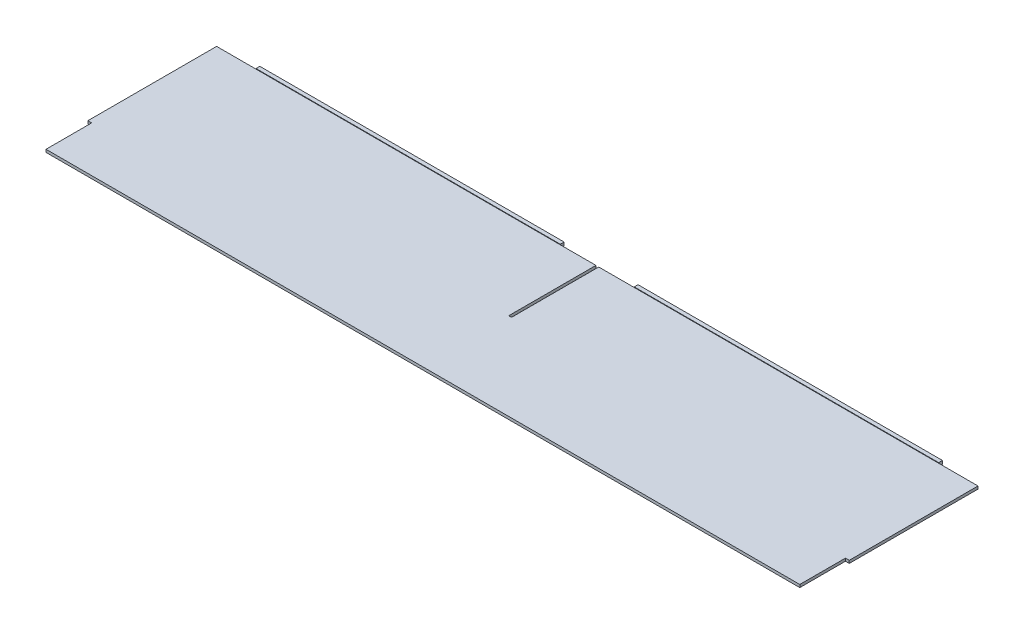
ISO-10303-21;
HEADER;
FILE_DESCRIPTION(('STEP AP214'),'2;1');
FILE_NAME('part.step','',(''),(''),'','','');
FILE_SCHEMA(('AUTOMOTIVE_DESIGN { 1 0 10303 214 1 1 1 1 }'));
ENDSEC;
DATA;
#1=APPLICATION_CONTEXT('core data for automotive mechanical design processes');
#2=APPLICATION_PROTOCOL_DEFINITION('international standard','automotive_design',2000,#1);
#3=PRODUCT_CONTEXT('',#1,'mechanical');
#4=PRODUCT('Part','Part','',(#3));
#5=PRODUCT_RELATED_PRODUCT_CATEGORY('part','',(#4));
#6=PRODUCT_DEFINITION_FORMATION('','',#4);
#7=PRODUCT_DEFINITION_CONTEXT('part definition',#1,'design');
#8=PRODUCT_DEFINITION('design','',#6,#7);
#9=PRODUCT_DEFINITION_SHAPE('','',#8);
#10=(LENGTH_UNIT() NAMED_UNIT(*) SI_UNIT(.MILLI.,.METRE.));
#11=(NAMED_UNIT(*) PLANE_ANGLE_UNIT() SI_UNIT($,.RADIAN.));
#12=(NAMED_UNIT(*) SI_UNIT($,.STERADIAN.) SOLID_ANGLE_UNIT());
#13=UNCERTAINTY_MEASURE_WITH_UNIT(LENGTH_MEASURE(1.E-05),#10,'distance_accuracy_value','');
#14=(GEOMETRIC_REPRESENTATION_CONTEXT(3) GLOBAL_UNCERTAINTY_ASSIGNED_CONTEXT((#13)) GLOBAL_UNIT_ASSIGNED_CONTEXT((#10,
#11,#12)) REPRESENTATION_CONTEXT('',''));
#15=CARTESIAN_POINT('',(0.,0.,0.));
#16=DIRECTION('',(0.,0.,1.));
#17=DIRECTION('',(1.,0.,0.));
#18=AXIS2_PLACEMENT_3D('',#15,#16,#17);
#19=CARTESIAN_POINT('',(-317.6778,1.143,-72.771));
#20=DIRECTION('',(0.,0.,1.));
#21=DIRECTION('',(1.,0.,0.));
#22=AXIS2_PLACEMENT_3D('',#19,#20,#21);
#23=PLANE('',#22);
#24=DIRECTION('',(-1.,0.,0.));
#25=VECTOR('',#24,1.);
#26=CARTESIAN_POINT('',(-317.6778,1.143,-72.771));
#27=LINE('',#26,#25);
#28=CARTESIAN_POINT('',(-1.14299999999913,1.143,-72.771));
#29=VERTEX_POINT('',#28);
#30=CARTESIAN_POINT('',(-30.8229000000015,1.143,-72.771));
#31=VERTEX_POINT('',#30);
#32=EDGE_CURVE('E200',#29,#31,#27,.T.);
#33=ORIENTED_EDGE('',*,*,#32,.F.);
#34=DIRECTION('',(0.,-1.,0.));
#35=VECTOR('',#34,1.);
#36=CARTESIAN_POINT('',(-1.14299999999912,1.143,-72.771));
#37=LINE('',#36,#35);
#38=CARTESIAN_POINT('',(-1.14299999999913,-1.143,-72.771));
#39=VERTEX_POINT('',#38);
#40=EDGE_CURVE('E11',#29,#39,#37,.T.);
#41=ORIENTED_EDGE('',*,*,#40,.T.);
#42=DIRECTION('',(-1.,0.,0.));
#43=VECTOR('',#42,1.);
#44=CARTESIAN_POINT('',(-317.6778,-1.143,-72.771));
#45=LINE('',#44,#43);
#46=CARTESIAN_POINT('',(-30.8229000000015,-1.143,-72.771));
#47=VERTEX_POINT('',#46);
#48=EDGE_CURVE('E198',#39,#47,#45,.T.);
#49=ORIENTED_EDGE('',*,*,#48,.T.);
#50=DIRECTION('',(0.,-1.,0.));
#51=VECTOR('',#50,1.);
#52=CARTESIAN_POINT('',(-30.8229000000015,-1.143,-72.771));
#53=LINE('',#52,#51);
#54=EDGE_CURVE('E232',#31,#47,#53,.T.);
#55=ORIENTED_EDGE('',*,*,#54,.F.);
#56=EDGE_LOOP('',(#33,#41,#49,#55));
#57=FACE_BOUND('',#56,.T.);
#58=ADVANCED_FACE('F34',(#57),#23,.F.);
#59=CARTESIAN_POINT('',(317.6778,1.143,-72.771));
#60=DIRECTION('',(-1.,0.,0.));
#61=DIRECTION('',(0.,0.,1.));
#62=AXIS2_PLACEMENT_3D('',#59,#60,#61);
#63=PLANE('',#62);
#64=DIRECTION('',(0.,-1.,0.));
#65=VECTOR('',#64,1.);
#66=CARTESIAN_POINT('',(317.6778,1.58749999999994,34.671));
#67=LINE('',#66,#65);
#68=CARTESIAN_POINT('',(317.6778,1.143,34.671));
#69=VERTEX_POINT('',#68);
#70=CARTESIAN_POINT('',(317.6778,-1.143,34.671));
#71=VERTEX_POINT('',#70);
#72=EDGE_CURVE('E298',#69,#71,#67,.T.);
#73=ORIENTED_EDGE('',*,*,#72,.T.);
#74=DIRECTION('',(0.,0.,-1.));
#75=VECTOR('',#74,1.);
#76=CARTESIAN_POINT('',(317.6778,-1.143,-72.771));
#77=LINE('',#76,#75);
#78=CARTESIAN_POINT('',(317.6778,-1.143,-72.771));
#79=VERTEX_POINT('',#78);
#80=EDGE_CURVE('E210',#71,#79,#77,.T.);
#81=ORIENTED_EDGE('',*,*,#80,.T.);
#82=DIRECTION('',(0.,-1.,0.));
#83=VECTOR('',#82,1.);
#84=CARTESIAN_POINT('',(317.6778,1.143,-72.771));
#85=LINE('',#84,#83);
#86=CARTESIAN_POINT('',(317.6778,1.143,-72.771));
#87=VERTEX_POINT('',#86);
#88=EDGE_CURVE('E230',#87,#79,#85,.T.);
#89=ORIENTED_EDGE('',*,*,#88,.F.);
#90=DIRECTION('',(0.,0.,-1.));
#91=VECTOR('',#90,1.);
#92=CARTESIAN_POINT('',(317.6778,1.143,-72.771));
#93=LINE('',#92,#91);
#94=EDGE_CURVE('E225',#69,#87,#93,.T.);
#95=ORIENTED_EDGE('',*,*,#94,.F.);
#96=EDGE_LOOP('',(#73,#81,#89,#95));
#97=FACE_BOUND('',#96,.T.);
#98=ADVANCED_FACE('F36',(#97),#63,.F.);
#99=CARTESIAN_POINT('',(-317.6778,1.143,72.771));
#100=DIRECTION('',(0.,0.,-1.));
#101=DIRECTION('',(-1.,0.,0.));
#102=AXIS2_PLACEMENT_3D('',#99,#100,#101);
#103=PLANE('',#102);
#104=DIRECTION('',(0.,-1.,0.));
#105=VECTOR('',#104,1.);
#106=CARTESIAN_POINT('',(314.5028,1.58749999999994,72.771));
#107=LINE('',#106,#105);
#108=CARTESIAN_POINT('',(314.5028,1.143,72.771));
#109=VERTEX_POINT('',#108);
#110=CARTESIAN_POINT('',(314.5028,-1.143,72.771));
#111=VERTEX_POINT('',#110);
#112=EDGE_CURVE('E57',#109,#111,#107,.T.);
#113=ORIENTED_EDGE('',*,*,#112,.F.);
#114=DIRECTION('',(1.,0.,0.));
#115=VECTOR('',#114,1.);
#116=CARTESIAN_POINT('',(-317.6778,1.143,72.771));
#117=LINE('',#116,#115);
#118=CARTESIAN_POINT('',(-314.5028,1.143,72.771));
#119=VERTEX_POINT('',#118);
#120=EDGE_CURVE('E231',#119,#109,#117,.T.);
#121=ORIENTED_EDGE('',*,*,#120,.F.);
#122=DIRECTION('',(0.,-1.,0.));
#123=VECTOR('',#122,1.);
#124=CARTESIAN_POINT('',(-314.5028,1.58749999999994,72.771));
#125=LINE('',#124,#123);
#126=CARTESIAN_POINT('',(-314.5028,-1.143,72.771));
#127=VERTEX_POINT('',#126);
#128=EDGE_CURVE('E322',#119,#127,#125,.T.);
#129=ORIENTED_EDGE('',*,*,#128,.T.);
#130=DIRECTION('',(1.,0.,0.));
#131=VECTOR('',#130,1.);
#132=CARTESIAN_POINT('',(-317.6778,-1.143,72.771));
#133=LINE('',#132,#131);
#134=EDGE_CURVE('E219',#127,#111,#133,.T.);
#135=ORIENTED_EDGE('',*,*,#134,.T.);
#136=EDGE_LOOP('',(#113,#121,#129,#135));
#137=FACE_BOUND('',#136,.T.);
#138=ADVANCED_FACE('F397',(#137),#103,.F.);
#139=CARTESIAN_POINT('',(0.,1.143,0.));
#140=DIRECTION('',(0.,1.,0.));
#141=DIRECTION('',(0.,0.,1.));
#142=AXIS2_PLACEMENT_3D('',#139,#140,#141);
#143=PLANE('',#142);
#144=DIRECTION('',(0.,0.,1.));
#145=VECTOR('',#144,1.);
#146=CARTESIAN_POINT('',(-1.14299999999912,1.143,0.));
#147=LINE('',#146,#145);
#148=CARTESIAN_POINT('',(-1.14299999999912,1.143,0.));
#149=VERTEX_POINT('',#148);
#150=EDGE_CURVE('E403',#29,#149,#147,.T.);
#151=ORIENTED_EDGE('',*,*,#150,.F.);
#152=ORIENTED_EDGE('',*,*,#32,.T.);
#153=CARTESIAN_POINT('',(-284.822900000001,1.143,-72.771));
#154=VERTEX_POINT('',#153);
#155=EDGE_CURVE('E289',#31,#154,#27,.T.);
#156=ORIENTED_EDGE('',*,*,#155,.T.);
#157=CARTESIAN_POINT('',(-317.6778,1.143,-72.771));
#158=VERTEX_POINT('',#157);
#159=EDGE_CURVE('E283',#154,#158,#27,.T.);
#160=ORIENTED_EDGE('',*,*,#159,.T.);
#161=DIRECTION('',(0.,0.,1.));
#162=VECTOR('',#161,1.);
#163=CARTESIAN_POINT('',(-317.6778,1.143,-72.771));
#164=LINE('',#163,#162);
#165=CARTESIAN_POINT('',(-317.6778,1.143,34.671));
#166=VERTEX_POINT('',#165);
#167=EDGE_CURVE('E287',#158,#166,#164,.T.);
#168=ORIENTED_EDGE('',*,*,#167,.T.);
#169=DIRECTION('',(-1.,0.,0.));
#170=VECTOR('',#169,1.);
#171=CARTESIAN_POINT('',(0.,1.143,34.671));
#172=LINE('',#171,#170);
#173=CARTESIAN_POINT('',(-314.5028,1.143,34.671));
#174=VERTEX_POINT('',#173);
#175=EDGE_CURVE('E325',#174,#166,#172,.T.);
#176=ORIENTED_EDGE('',*,*,#175,.F.);
#177=DIRECTION('',(0.,0.,-1.));
#178=VECTOR('',#177,1.);
#179=CARTESIAN_POINT('',(-314.5028,1.143,0.));
#180=LINE('',#179,#178);
#181=EDGE_CURVE('E330',#119,#174,#180,.T.);
#182=ORIENTED_EDGE('',*,*,#181,.F.);
#183=ORIENTED_EDGE('',*,*,#120,.T.);
#184=DIRECTION('',(0.,0.,-1.));
#185=VECTOR('',#184,1.);
#186=CARTESIAN_POINT('',(314.5028,1.143,0.));
#187=LINE('',#186,#185);
#188=CARTESIAN_POINT('',(314.5028,1.143,34.671));
#189=VERTEX_POINT('',#188);
#190=EDGE_CURVE('E309',#109,#189,#187,.T.);
#191=ORIENTED_EDGE('',*,*,#190,.T.);
#192=DIRECTION('',(1.,0.,0.));
#193=VECTOR('',#192,1.);
#194=CARTESIAN_POINT('',(0.,1.143,34.671));
#195=LINE('',#194,#193);
#196=EDGE_CURVE('E308',#189,#69,#195,.T.);
#197=ORIENTED_EDGE('',*,*,#196,.T.);
#198=ORIENTED_EDGE('',*,*,#94,.T.);
#199=CARTESIAN_POINT('',(284.822900000001,1.143,-72.771));
#200=VERTEX_POINT('',#199);
#201=EDGE_CURVE('E284',#87,#200,#27,.T.);
#202=ORIENTED_EDGE('',*,*,#201,.T.);
#203=DIRECTION('',(1.,0.,0.));
#204=VECTOR('',#203,1.);
#205=CARTESIAN_POINT('',(0.,1.143,-72.771));
#206=LINE('',#205,#204);
#207=CARTESIAN_POINT('',(30.8229000000014,1.143,-72.771));
#208=VERTEX_POINT('',#207);
#209=EDGE_CURVE('E242',#208,#200,#206,.T.);
#210=ORIENTED_EDGE('',*,*,#209,.F.);
#211=CARTESIAN_POINT('',(1.19380000000086,1.143,-72.771));
#212=VERTEX_POINT('',#211);
#213=EDGE_CURVE('E288',#208,#212,#27,.T.);
#214=ORIENTED_EDGE('',*,*,#213,.T.);
#215=DIRECTION('',(0.,0.,-1.));
#216=VECTOR('',#215,1.);
#217=CARTESIAN_POINT('',(1.19380000000088,1.143,0.));
#218=LINE('',#217,#216);
#219=CARTESIAN_POINT('',(1.19380000000088,1.143,0.));
#220=VERTEX_POINT('',#219);
#221=EDGE_CURVE('E49',#220,#212,#218,.T.);
#222=ORIENTED_EDGE('',*,*,#221,.F.);
#223=DIRECTION('',(1.,0.,0.));
#224=VECTOR('',#223,1.);
#225=CARTESIAN_POINT('',(0.,1.143,0.));
#226=LINE('',#225,#224);
#227=EDGE_CURVE('E400',#149,#220,#226,.T.);
#228=ORIENTED_EDGE('',*,*,#227,.F.);
#229=EDGE_LOOP('',(#151,#152,#156,#160,#168,#176,#182,#183,#191,#197,#198,#202,#210,#214,#222,#228));
#230=FACE_BOUND('',#229,.T.);
#231=ADVANCED_FACE('F305',(#230),#143,.T.);
#232=CARTESIAN_POINT('',(0.,-1.143,0.));
#233=DIRECTION('',(0.,1.,0.));
#234=DIRECTION('',(0.,0.,1.));
#235=AXIS2_PLACEMENT_3D('',#232,#233,#234);
#236=PLANE('',#235);
#237=ORIENTED_EDGE('',*,*,#48,.F.);
#238=DIRECTION('',(0.,0.,-1.));
#239=VECTOR('',#238,1.);
#240=CARTESIAN_POINT('',(-1.14299999999913,-1.143,-72.771));
#241=LINE('',#240,#239);
#242=CARTESIAN_POINT('',(-1.14299999999912,-1.143,0.));
#243=VERTEX_POINT('',#242);
#244=EDGE_CURVE('E184',#243,#39,#241,.T.);
#245=ORIENTED_EDGE('',*,*,#244,.F.);
#246=DIRECTION('',(-1.,0.,0.));
#247=VECTOR('',#246,1.);
#248=CARTESIAN_POINT('',(-1.14299999999912,-1.143,0.));
#249=LINE('',#248,#247);
#250=CARTESIAN_POINT('',(1.19380000000088,-1.143,0.));
#251=VERTEX_POINT('',#250);
#252=EDGE_CURVE('E549',#251,#243,#249,.T.);
#253=ORIENTED_EDGE('',*,*,#252,.F.);
#254=DIRECTION('',(0.,0.,1.));
#255=VECTOR('',#254,1.);
#256=CARTESIAN_POINT('',(1.19380000000087,-1.143,-72.771));
#257=LINE('',#256,#255);
#258=CARTESIAN_POINT('',(1.19380000000087,-1.143,-72.771));
#259=VERTEX_POINT('',#258);
#260=EDGE_CURVE('E193',#259,#251,#257,.T.);
#261=ORIENTED_EDGE('',*,*,#260,.F.);
#262=CARTESIAN_POINT('',(30.8229000000015,-1.143,-72.771));
#263=VERTEX_POINT('',#262);
#264=EDGE_CURVE('E205',#263,#259,#45,.T.);
#265=ORIENTED_EDGE('',*,*,#264,.F.);
#266=DIRECTION('',(0.,0.,1.));
#267=VECTOR('',#266,1.);
#268=CARTESIAN_POINT('',(30.8229000000015,-1.143,-75.946));
#269=LINE('',#268,#267);
#270=CARTESIAN_POINT('',(30.8229000000015,-1.143,-75.946));
#271=VERTEX_POINT('',#270);
#272=EDGE_CURVE('E255',#271,#263,#269,.T.);
#273=ORIENTED_EDGE('',*,*,#272,.F.);
#274=DIRECTION('',(-1.,0.,0.));
#275=VECTOR('',#274,1.);
#276=CARTESIAN_POINT('',(284.822900000001,-1.143,-75.946));
#277=LINE('',#276,#275);
#278=CARTESIAN_POINT('',(284.822900000001,-1.143,-75.946));
#279=VERTEX_POINT('',#278);
#280=EDGE_CURVE('E335',#279,#271,#277,.T.);
#281=ORIENTED_EDGE('',*,*,#280,.F.);
#282=DIRECTION('',(0.,0.,1.));
#283=VECTOR('',#282,1.);
#284=CARTESIAN_POINT('',(284.822900000001,-1.143,-75.946));
#285=LINE('',#284,#283);
#286=CARTESIAN_POINT('',(284.822900000001,-1.143,-72.771));
#287=VERTEX_POINT('',#286);
#288=EDGE_CURVE('E247',#279,#287,#285,.T.);
#289=ORIENTED_EDGE('',*,*,#288,.T.);
#290=EDGE_CURVE('E208',#79,#287,#45,.T.);
#291=ORIENTED_EDGE('',*,*,#290,.F.);
#292=ORIENTED_EDGE('',*,*,#80,.F.);
#293=DIRECTION('',(-1.,0.,0.));
#294=VECTOR('',#293,1.);
#295=CARTESIAN_POINT('',(317.6778,-1.143,34.671));
#296=LINE('',#295,#294);
#297=CARTESIAN_POINT('',(314.5028,-1.143,34.671));
#298=VERTEX_POINT('',#297);
#299=EDGE_CURVE('E399',#71,#298,#296,.T.);
#300=ORIENTED_EDGE('',*,*,#299,.T.);
#301=DIRECTION('',(0.,0.,1.));
#302=VECTOR('',#301,1.);
#303=CARTESIAN_POINT('',(314.5028,-1.143,72.771));
#304=LINE('',#303,#302);
#305=EDGE_CURVE('E398',#298,#111,#304,.T.);
#306=ORIENTED_EDGE('',*,*,#305,.T.);
#307=ORIENTED_EDGE('',*,*,#134,.F.);
#308=DIRECTION('',(0.,0.,1.));
#309=VECTOR('',#308,1.);
#310=CARTESIAN_POINT('',(-314.5028,-1.143,72.771));
#311=LINE('',#310,#309);
#312=CARTESIAN_POINT('',(-314.5028,-1.143,34.671));
#313=VERTEX_POINT('',#312);
#314=EDGE_CURVE('E315',#313,#127,#311,.T.);
#315=ORIENTED_EDGE('',*,*,#314,.F.);
#316=DIRECTION('',(1.,0.,0.));
#317=VECTOR('',#316,1.);
#318=CARTESIAN_POINT('',(-317.6778,-1.143,34.671));
#319=LINE('',#318,#317);
#320=CARTESIAN_POINT('',(-317.6778,-1.143,34.671));
#321=VERTEX_POINT('',#320);
#322=EDGE_CURVE('E312',#321,#313,#319,.T.);
#323=ORIENTED_EDGE('',*,*,#322,.F.);
#324=DIRECTION('',(0.,0.,1.));
#325=VECTOR('',#324,1.);
#326=CARTESIAN_POINT('',(-317.6778,-1.143,-72.771));
#327=LINE('',#326,#325);
#328=CARTESIAN_POINT('',(-317.6778,-1.143,-72.771));
#329=VERTEX_POINT('',#328);
#330=EDGE_CURVE('E213',#329,#321,#327,.T.);
#331=ORIENTED_EDGE('',*,*,#330,.F.);
#332=CARTESIAN_POINT('',(-284.822900000001,-1.143,-72.771));
#333=VERTEX_POINT('',#332);
#334=EDGE_CURVE('E206',#333,#329,#45,.T.);
#335=ORIENTED_EDGE('',*,*,#334,.F.);
#336=DIRECTION('',(0.,0.,1.));
#337=VECTOR('',#336,1.);
#338=CARTESIAN_POINT('',(-284.822900000001,-1.143,-75.946));
#339=LINE('',#338,#337);
#340=CARTESIAN_POINT('',(-284.822900000001,-1.143,-75.946));
#341=VERTEX_POINT('',#340);
#342=EDGE_CURVE('E275',#341,#333,#339,.T.);
#343=ORIENTED_EDGE('',*,*,#342,.F.);
#344=DIRECTION('',(-1.,0.,0.));
#345=VECTOR('',#344,1.);
#346=CARTESIAN_POINT('',(-30.8229000000015,-1.143,-75.946));
#347=LINE('',#346,#345);
#348=CARTESIAN_POINT('',(-30.8229000000015,-1.143,-75.946));
#349=VERTEX_POINT('',#348);
#350=EDGE_CURVE('E262',#349,#341,#347,.T.);
#351=ORIENTED_EDGE('',*,*,#350,.F.);
#352=DIRECTION('',(0.,0.,1.));
#353=VECTOR('',#352,1.);
#354=CARTESIAN_POINT('',(-30.8229000000015,-1.143,-75.946));
#355=LINE('',#354,#353);
#356=EDGE_CURVE('E204',#349,#47,#355,.T.);
#357=ORIENTED_EDGE('',*,*,#356,.T.);
#358=EDGE_LOOP('',(#237,#245,#253,#261,#265,#273,#281,#289,#291,#292,#300,#306,#307,#315,#323,
#331,#335,#343,#351,#357));
#359=FACE_BOUND('',#358,.T.);
#360=ADVANCED_FACE('F202',(#359),#236,.F.);
#361=DIRECTION('',(0.,-1.,0.));
#362=VECTOR('',#361,1.);
#363=CARTESIAN_POINT('',(284.822900000001,-1.143,-72.771));
#364=LINE('',#363,#362);
#365=EDGE_CURVE('E303',#200,#287,#364,.T.);
#366=ORIENTED_EDGE('',*,*,#365,.F.);
#367=ORIENTED_EDGE('',*,*,#201,.F.);
#368=ORIENTED_EDGE('',*,*,#88,.T.);
#369=ORIENTED_EDGE('',*,*,#290,.T.);
#370=EDGE_LOOP('',(#366,#367,#368,#369));
#371=FACE_BOUND('',#370,.T.);
#372=ADVANCED_FACE('F302',(#371),#23,.F.);
#373=ORIENTED_EDGE('',*,*,#264,.T.);
#374=DIRECTION('',(0.,1.,0.));
#375=VECTOR('',#374,1.);
#376=CARTESIAN_POINT('',(1.19380000000086,1.143,-72.771));
#377=LINE('',#376,#375);
#378=EDGE_CURVE('E42',#259,#212,#377,.T.);
#379=ORIENTED_EDGE('',*,*,#378,.T.);
#380=ORIENTED_EDGE('',*,*,#213,.F.);
#381=DIRECTION('',(0.,1.,0.));
#382=VECTOR('',#381,1.);
#383=CARTESIAN_POINT('',(30.8229000000015,1.58749999999994,-72.771));
#384=LINE('',#383,#382);
#385=EDGE_CURVE('E346',#263,#208,#384,.T.);
#386=ORIENTED_EDGE('',*,*,#385,.F.);
#387=EDGE_LOOP('',(#373,#379,#380,#386));
#388=FACE_BOUND('',#387,.T.);
#389=ADVANCED_FACE('F363',(#388),#23,.F.);
#390=DIRECTION('',(0.,1.,0.));
#391=VECTOR('',#390,1.);
#392=CARTESIAN_POINT('',(-284.822900000001,1.58749999999994,-72.771));
#393=LINE('',#392,#391);
#394=EDGE_CURVE('E245',#333,#154,#393,.T.);
#395=ORIENTED_EDGE('',*,*,#394,.F.);
#396=ORIENTED_EDGE('',*,*,#334,.T.);
#397=DIRECTION('',(0.,-1.,0.));
#398=VECTOR('',#397,1.);
#399=CARTESIAN_POINT('',(-317.6778,1.143,-72.771));
#400=LINE('',#399,#398);
#401=EDGE_CURVE('E228',#158,#329,#400,.T.);
#402=ORIENTED_EDGE('',*,*,#401,.F.);
#403=ORIENTED_EDGE('',*,*,#159,.F.);
#404=EDGE_LOOP('',(#395,#396,#402,#403));
#405=FACE_BOUND('',#404,.T.);
#406=ADVANCED_FACE('F370',(#405),#23,.F.);
#407=CARTESIAN_POINT('',(-317.6778,1.143,-72.771));
#408=DIRECTION('',(1.,0.,0.));
#409=DIRECTION('',(0.,0.,-1.));
#410=AXIS2_PLACEMENT_3D('',#407,#408,#409);
#411=PLANE('',#410);
#412=ORIENTED_EDGE('',*,*,#330,.T.);
#413=DIRECTION('',(0.,-1.,0.));
#414=VECTOR('',#413,1.);
#415=CARTESIAN_POINT('',(-317.6778,1.58749999999994,34.671));
#416=LINE('',#415,#414);
#417=EDGE_CURVE('E321',#166,#321,#416,.T.);
#418=ORIENTED_EDGE('',*,*,#417,.F.);
#419=ORIENTED_EDGE('',*,*,#167,.F.);
#420=ORIENTED_EDGE('',*,*,#401,.T.);
#421=EDGE_LOOP('',(#412,#418,#419,#420));
#422=FACE_BOUND('',#421,.T.);
#423=ADVANCED_FACE('F385',(#422),#411,.F.);
#424=CARTESIAN_POINT('',(0.,0.,-72.771));
#425=DIRECTION('',(0.,0.,1.));
#426=DIRECTION('',(1.,0.,0.));
#427=AXIS2_PLACEMENT_3D('',#424,#425,#426);
#428=PLANE('',#427);
#429=ORIENTED_EDGE('',*,*,#155,.F.);
#430=CARTESIAN_POINT('',(-30.8229000000015,1.58749999999994,-72.771));
#431=VERTEX_POINT('',#430);
#432=EDGE_CURVE('E236',#431,#31,#53,.T.);
#433=ORIENTED_EDGE('',*,*,#432,.F.);
#434=DIRECTION('',(1.,0.,0.));
#435=VECTOR('',#434,1.);
#436=CARTESIAN_POINT('',(-30.8229000000015,1.58749999999994,-72.771));
#437=LINE('',#436,#435);
#438=CARTESIAN_POINT('',(-284.822900000001,1.58749999999994,-72.771));
#439=VERTEX_POINT('',#438);
#440=EDGE_CURVE('E263',#439,#431,#437,.T.);
#441=ORIENTED_EDGE('',*,*,#440,.F.);
#442=EDGE_CURVE('E241',#154,#439,#393,.T.);
#443=ORIENTED_EDGE('',*,*,#442,.F.);
#444=EDGE_LOOP('',(#429,#433,#441,#443));
#445=FACE_BOUND('',#444,.T.);
#446=ADVANCED_FACE('F375',(#445),#428,.T.);
#447=CARTESIAN_POINT('',(-30.8229000000015,-1.143,-75.946));
#448=DIRECTION('',(-1.,0.,0.));
#449=DIRECTION('',(0.,0.,1.));
#450=AXIS2_PLACEMENT_3D('',#447,#448,#449);
#451=PLANE('',#450);
#452=ORIENTED_EDGE('',*,*,#432,.T.);
#453=ORIENTED_EDGE('',*,*,#54,.T.);
#454=ORIENTED_EDGE('',*,*,#356,.F.);
#455=DIRECTION('',(0.,-1.,0.));
#456=VECTOR('',#455,1.);
#457=CARTESIAN_POINT('',(-30.8229000000015,-1.143,-75.946));
#458=LINE('',#457,#456);
#459=CARTESIAN_POINT('',(-30.8229000000015,1.58749999999994,-75.946));
#460=VERTEX_POINT('',#459);
#461=EDGE_CURVE('E259',#460,#349,#458,.T.);
#462=ORIENTED_EDGE('',*,*,#461,.F.);
#463=DIRECTION('',(0.,0.,1.));
#464=VECTOR('',#463,1.);
#465=CARTESIAN_POINT('',(-30.8229000000015,1.58749999999994,-75.946));
#466=LINE('',#465,#464);
#467=EDGE_CURVE('E267',#460,#431,#466,.T.);
#468=ORIENTED_EDGE('',*,*,#467,.T.);
#469=EDGE_LOOP('',(#452,#453,#454,#462,#468));
#470=FACE_BOUND('',#469,.T.);
#471=ADVANCED_FACE('F439',(#470),#451,.F.);
#472=CARTESIAN_POINT('',(-284.822900000001,1.58749999999994,-75.946));
#473=DIRECTION('',(1.,0.,0.));
#474=DIRECTION('',(0.,1.,0.));
#475=AXIS2_PLACEMENT_3D('',#472,#473,#474);
#476=PLANE('',#475);
#477=ORIENTED_EDGE('',*,*,#394,.T.);
#478=ORIENTED_EDGE('',*,*,#442,.T.);
#479=DIRECTION('',(0.,0.,1.));
#480=VECTOR('',#479,1.);
#481=CARTESIAN_POINT('',(-284.822900000001,1.58749999999994,-75.946));
#482=LINE('',#481,#480);
#483=CARTESIAN_POINT('',(-284.822900000001,1.58749999999994,-75.946));
#484=VERTEX_POINT('',#483);
#485=EDGE_CURVE('E271',#484,#439,#482,.T.);
#486=ORIENTED_EDGE('',*,*,#485,.F.);
#487=DIRECTION('',(0.,1.,0.));
#488=VECTOR('',#487,1.);
#489=CARTESIAN_POINT('',(-284.822900000001,1.58749999999994,-75.946));
#490=LINE('',#489,#488);
#491=EDGE_CURVE('E265',#341,#484,#490,.T.);
#492=ORIENTED_EDGE('',*,*,#491,.F.);
#493=ORIENTED_EDGE('',*,*,#342,.T.);
#494=EDGE_LOOP('',(#477,#478,#486,#492,#493));
#495=FACE_BOUND('',#494,.T.);
#496=ADVANCED_FACE('F378',(#495),#476,.F.);
#497=CARTESIAN_POINT('',(-30.8229000000015,1.58749999999994,-75.946));
#498=DIRECTION('',(0.,-1.,0.));
#499=DIRECTION('',(0.,0.,-1.));
#500=AXIS2_PLACEMENT_3D('',#497,#498,#499);
#501=PLANE('',#500);
#502=ORIENTED_EDGE('',*,*,#440,.T.);
#503=ORIENTED_EDGE('',*,*,#467,.F.);
#504=DIRECTION('',(1.,0.,0.));
#505=VECTOR('',#504,1.);
#506=CARTESIAN_POINT('',(-30.8229000000015,1.58749999999994,-75.946));
#507=LINE('',#506,#505);
#508=EDGE_CURVE('E266',#484,#460,#507,.T.);
#509=ORIENTED_EDGE('',*,*,#508,.F.);
#510=ORIENTED_EDGE('',*,*,#485,.T.);
#511=EDGE_LOOP('',(#502,#503,#509,#510));
#512=FACE_BOUND('',#511,.T.);
#513=ADVANCED_FACE('F382',(#512),#501,.F.);
#514=CARTESIAN_POINT('',(0.,0.,-75.946));
#515=DIRECTION('',(0.,0.,1.));
#516=DIRECTION('',(1.,0.,0.));
#517=AXIS2_PLACEMENT_3D('',#514,#515,#516);
#518=PLANE('',#517);
#519=ORIENTED_EDGE('',*,*,#461,.T.);
#520=ORIENTED_EDGE('',*,*,#350,.T.);
#521=ORIENTED_EDGE('',*,*,#491,.T.);
#522=ORIENTED_EDGE('',*,*,#508,.T.);
#523=EDGE_LOOP('',(#519,#520,#521,#522));
#524=FACE_BOUND('',#523,.T.);
#525=ADVANCED_FACE('F383',(#524),#518,.F.);
#526=CARTESIAN_POINT('',(284.822900000001,-1.143,-75.946));
#527=DIRECTION('',(-1.,0.,0.));
#528=DIRECTION('',(0.,-1.,0.));
#529=AXIS2_PLACEMENT_3D('',#526,#527,#528);
#530=PLANE('',#529);
#531=CARTESIAN_POINT('',(284.822900000001,1.58749999999994,-72.771));
#532=VERTEX_POINT('',#531);
#533=EDGE_CURVE('E343',#532,#200,#364,.T.);
#534=ORIENTED_EDGE('',*,*,#533,.T.);
#535=ORIENTED_EDGE('',*,*,#365,.T.);
#536=ORIENTED_EDGE('',*,*,#288,.F.);
#537=DIRECTION('',(0.,-1.,0.));
#538=VECTOR('',#537,1.);
#539=CARTESIAN_POINT('',(284.822900000001,-1.143,-75.946));
#540=LINE('',#539,#538);
#541=CARTESIAN_POINT('',(284.822900000001,1.58749999999994,-75.946));
#542=VERTEX_POINT('',#541);
#543=EDGE_CURVE('E332',#542,#279,#540,.T.);
#544=ORIENTED_EDGE('',*,*,#543,.F.);
#545=DIRECTION('',(0.,0.,1.));
#546=VECTOR('',#545,1.);
#547=CARTESIAN_POINT('',(284.822900000001,1.58749999999994,-75.946));
#548=LINE('',#547,#546);
#549=EDGE_CURVE('E342',#542,#532,#548,.T.);
#550=ORIENTED_EDGE('',*,*,#549,.T.);
#551=EDGE_LOOP('',(#534,#535,#536,#544,#550));
#552=FACE_BOUND('',#551,.T.);
#553=ADVANCED_FACE('F454',(#552),#530,.F.);
#554=CARTESIAN_POINT('',(30.8229000000015,1.58749999999994,-75.946));
#555=DIRECTION('',(1.,0.,0.));
#556=DIRECTION('',(0.,0.,-1.));
#557=AXIS2_PLACEMENT_3D('',#554,#555,#556);
#558=PLANE('',#557);
#559=ORIENTED_EDGE('',*,*,#385,.T.);
#560=CARTESIAN_POINT('',(30.8229000000015,1.58749999999994,-72.771));
#561=VERTEX_POINT('',#560);
#562=EDGE_CURVE('E345',#208,#561,#384,.T.);
#563=ORIENTED_EDGE('',*,*,#562,.T.);
#564=DIRECTION('',(0.,0.,1.));
#565=VECTOR('',#564,1.);
#566=CARTESIAN_POINT('',(30.8229000000015,1.58749999999994,-75.946));
#567=LINE('',#566,#565);
#568=CARTESIAN_POINT('',(30.8229000000015,1.58749999999994,-75.946));
#569=VERTEX_POINT('',#568);
#570=EDGE_CURVE('E352',#569,#561,#567,.T.);
#571=ORIENTED_EDGE('',*,*,#570,.F.);
#572=DIRECTION('',(0.,1.,0.));
#573=VECTOR('',#572,1.);
#574=CARTESIAN_POINT('',(30.8229000000015,1.58749999999994,-75.946));
#575=LINE('',#574,#573);
#576=EDGE_CURVE('E338',#271,#569,#575,.T.);
#577=ORIENTED_EDGE('',*,*,#576,.F.);
#578=ORIENTED_EDGE('',*,*,#272,.T.);
#579=EDGE_LOOP('',(#559,#563,#571,#577,#578));
#580=FACE_BOUND('',#579,.T.);
#581=ADVANCED_FACE('F358',(#580),#558,.F.);
#582=CARTESIAN_POINT('',(284.822900000001,1.58749999999994,-75.946));
#583=DIRECTION('',(0.,-1.,0.));
#584=DIRECTION('',(0.,0.,-1.));
#585=AXIS2_PLACEMENT_3D('',#582,#583,#584);
#586=PLANE('',#585);
#587=DIRECTION('',(1.,0.,0.));
#588=VECTOR('',#587,1.);
#589=CARTESIAN_POINT('',(284.822900000001,1.58749999999994,-72.771));
#590=LINE('',#589,#588);
#591=EDGE_CURVE('E336',#561,#532,#590,.T.);
#592=ORIENTED_EDGE('',*,*,#591,.T.);
#593=ORIENTED_EDGE('',*,*,#549,.F.);
#594=DIRECTION('',(1.,0.,0.));
#595=VECTOR('',#594,1.);
#596=CARTESIAN_POINT('',(284.822900000001,1.58749999999994,-75.946));
#597=LINE('',#596,#595);
#598=EDGE_CURVE('E340',#569,#542,#597,.T.);
#599=ORIENTED_EDGE('',*,*,#598,.F.);
#600=ORIENTED_EDGE('',*,*,#570,.T.);
#601=EDGE_LOOP('',(#592,#593,#599,#600));
#602=FACE_BOUND('',#601,.T.);
#603=ADVANCED_FACE('F460',(#602),#586,.F.);
#604=CARTESIAN_POINT('',(0.,0.,-75.946));
#605=DIRECTION('',(0.,0.,1.));
#606=DIRECTION('',(1.,0.,0.));
#607=AXIS2_PLACEMENT_3D('',#604,#605,#606);
#608=PLANE('',#607);
#609=ORIENTED_EDGE('',*,*,#543,.T.);
#610=ORIENTED_EDGE('',*,*,#280,.T.);
#611=ORIENTED_EDGE('',*,*,#576,.T.);
#612=ORIENTED_EDGE('',*,*,#598,.T.);
#613=EDGE_LOOP('',(#609,#610,#611,#612));
#614=FACE_BOUND('',#613,.T.);
#615=ADVANCED_FACE('F463',(#614),#608,.F.);
#616=CARTESIAN_POINT('',(0.,0.,-72.771));
#617=DIRECTION('',(0.,0.,1.));
#618=DIRECTION('',(1.,0.,0.));
#619=AXIS2_PLACEMENT_3D('',#616,#617,#618);
#620=PLANE('',#619);
#621=ORIENTED_EDGE('',*,*,#562,.F.);
#622=ORIENTED_EDGE('',*,*,#209,.T.);
#623=ORIENTED_EDGE('',*,*,#533,.F.);
#624=ORIENTED_EDGE('',*,*,#591,.F.);
#625=EDGE_LOOP('',(#621,#622,#623,#624));
#626=FACE_BOUND('',#625,.T.);
#627=ADVANCED_FACE('F465',(#626),#620,.T.);
#628=CARTESIAN_POINT('',(-314.5028,1.58749999999994,72.771));
#629=DIRECTION('',(1.,0.,0.));
#630=DIRECTION('',(0.,0.,-1.));
#631=AXIS2_PLACEMENT_3D('',#628,#629,#630);
#632=PLANE('',#631);
#633=ORIENTED_EDGE('',*,*,#181,.T.);
#634=DIRECTION('',(0.,-1.,0.));
#635=VECTOR('',#634,1.);
#636=CARTESIAN_POINT('',(-314.5028,1.58749999999994,34.671));
#637=LINE('',#636,#635);
#638=EDGE_CURVE('E326',#174,#313,#637,.T.);
#639=ORIENTED_EDGE('',*,*,#638,.T.);
#640=ORIENTED_EDGE('',*,*,#314,.T.);
#641=ORIENTED_EDGE('',*,*,#128,.F.);
#642=EDGE_LOOP('',(#633,#639,#640,#641));
#643=FACE_BOUND('',#642,.T.);
#644=ADVANCED_FACE('F394',(#643),#632,.F.);
#645=CARTESIAN_POINT('',(-317.6778,1.58749999999994,34.671));
#646=DIRECTION('',(0.,0.,-1.));
#647=DIRECTION('',(-1.,0.,0.));
#648=AXIS2_PLACEMENT_3D('',#645,#646,#647);
#649=PLANE('',#648);
#650=ORIENTED_EDGE('',*,*,#175,.T.);
#651=ORIENTED_EDGE('',*,*,#417,.T.);
#652=ORIENTED_EDGE('',*,*,#322,.T.);
#653=ORIENTED_EDGE('',*,*,#638,.F.);
#654=EDGE_LOOP('',(#650,#651,#652,#653));
#655=FACE_BOUND('',#654,.T.);
#656=ADVANCED_FACE('F391',(#655),#649,.F.);
#657=CARTESIAN_POINT('',(317.6778,1.58749999999994,34.671));
#658=DIRECTION('',(0.,0.,1.));
#659=DIRECTION('',(1.,0.,0.));
#660=AXIS2_PLACEMENT_3D('',#657,#658,#659);
#661=PLANE('',#660);
#662=DIRECTION('',(0.,-1.,0.));
#663=VECTOR('',#662,1.);
#664=CARTESIAN_POINT('',(314.5028,1.58749999999994,34.671));
#665=LINE('',#664,#663);
#666=EDGE_CURVE('E408',#189,#298,#665,.T.);
#667=ORIENTED_EDGE('',*,*,#666,.T.);
#668=ORIENTED_EDGE('',*,*,#299,.F.);
#669=ORIENTED_EDGE('',*,*,#72,.F.);
#670=ORIENTED_EDGE('',*,*,#196,.F.);
#671=EDGE_LOOP('',(#667,#668,#669,#670));
#672=FACE_BOUND('',#671,.T.);
#673=ADVANCED_FACE('F409',(#672),#661,.T.);
#674=CARTESIAN_POINT('',(314.5028,1.58749999999994,72.771));
#675=DIRECTION('',(1.,0.,0.));
#676=DIRECTION('',(0.,0.,-1.));
#677=AXIS2_PLACEMENT_3D('',#674,#675,#676);
#678=PLANE('',#677);
#679=ORIENTED_EDGE('',*,*,#112,.T.);
#680=ORIENTED_EDGE('',*,*,#305,.F.);
#681=ORIENTED_EDGE('',*,*,#666,.F.);
#682=ORIENTED_EDGE('',*,*,#190,.F.);
#683=EDGE_LOOP('',(#679,#680,#681,#682));
#684=FACE_BOUND('',#683,.T.);
#685=ADVANCED_FACE('F410',(#684),#678,.T.);
#686=CARTESIAN_POINT('',(-1.14299999999913,1.58749999999994,-72.771));
#687=DIRECTION('',(-1.,0.,0.));
#688=DIRECTION('',(0.,0.,1.));
#689=AXIS2_PLACEMENT_3D('',#686,#687,#688);
#690=PLANE('',#689);
#691=ORIENTED_EDGE('',*,*,#150,.T.);
#692=DIRECTION('',(0.,-1.,0.));
#693=VECTOR('',#692,1.);
#694=CARTESIAN_POINT('',(-1.14299999999912,1.58749999999994,0.));
#695=LINE('',#694,#693);
#696=EDGE_CURVE('E188',#149,#243,#695,.T.);
#697=ORIENTED_EDGE('',*,*,#696,.T.);
#698=ORIENTED_EDGE('',*,*,#244,.T.);
#699=ORIENTED_EDGE('',*,*,#40,.F.);
#700=EDGE_LOOP('',(#691,#697,#698,#699));
#701=FACE_BOUND('',#700,.T.);
#702=ADVANCED_FACE('F185',(#701),#690,.F.);
#703=CARTESIAN_POINT('',(-1.14299999999912,1.58749999999994,0.));
#704=DIRECTION('',(0.,0.,1.));
#705=DIRECTION('',(1.,0.,0.));
#706=AXIS2_PLACEMENT_3D('',#703,#704,#705);
#707=PLANE('',#706);
#708=ORIENTED_EDGE('',*,*,#227,.T.);
#709=DIRECTION('',(0.,-1.,0.));
#710=VECTOR('',#709,1.);
#711=CARTESIAN_POINT('',(1.19380000000088,1.58749999999994,0.));
#712=LINE('',#711,#710);
#713=EDGE_CURVE('E548',#220,#251,#712,.T.);
#714=ORIENTED_EDGE('',*,*,#713,.T.);
#715=ORIENTED_EDGE('',*,*,#252,.T.);
#716=ORIENTED_EDGE('',*,*,#696,.F.);
#717=EDGE_LOOP('',(#708,#714,#715,#716));
#718=FACE_BOUND('',#717,.T.);
#719=ADVANCED_FACE('F417',(#718),#707,.F.);
#720=CARTESIAN_POINT('',(1.19380000000087,1.58749999999994,-72.771));
#721=DIRECTION('',(1.,0.,0.));
#722=DIRECTION('',(0.,0.,-1.));
#723=AXIS2_PLACEMENT_3D('',#720,#721,#722);
#724=PLANE('',#723);
#725=ORIENTED_EDGE('',*,*,#221,.T.);
#726=ORIENTED_EDGE('',*,*,#378,.F.);
#727=ORIENTED_EDGE('',*,*,#260,.T.);
#728=ORIENTED_EDGE('',*,*,#713,.F.);
#729=EDGE_LOOP('',(#725,#726,#727,#728));
#730=FACE_BOUND('',#729,.T.);
#731=ADVANCED_FACE('F534',(#730),#724,.F.);
#732=CLOSED_SHELL('',(#58,#98,#138,#231,#360,#372,#389,#406,#423,#446,#471,#496,#513,#525,#553,
#581,#603,#615,#627,#644,#656,#673,#685,#702,#719,#731));
#733=MANIFOLD_SOLID_BREP('B2',#732);
#734=ADVANCED_BREP_SHAPE_REPRESENTATION('',(#18,#733),#14);
#735=SHAPE_DEFINITION_REPRESENTATION(#9,#734);
ENDSEC;
END-ISO-10303-21;
